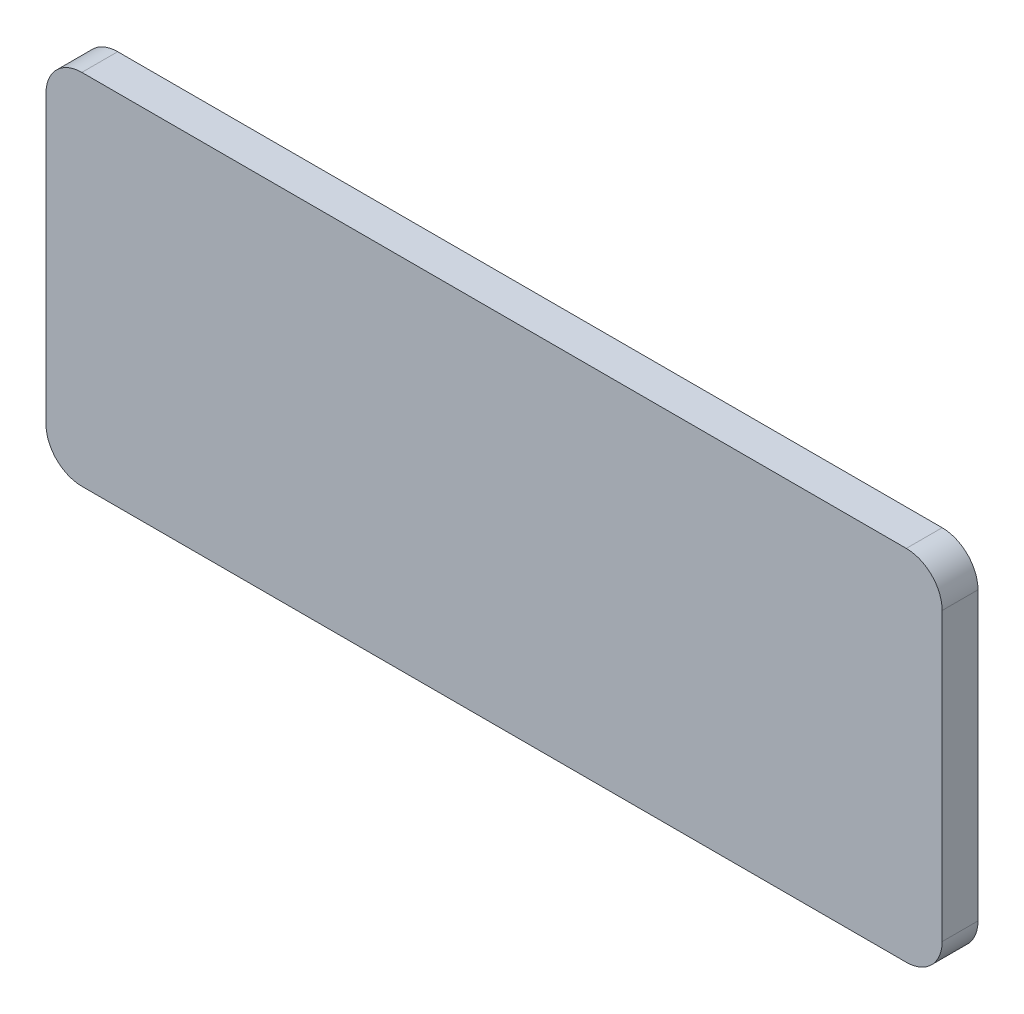
ISO-10303-21;
HEADER;
FILE_DESCRIPTION(('STEP AP214'),'2;1');
FILE_NAME('part.step','',(''),(''),'','','');
FILE_SCHEMA(('AUTOMOTIVE_DESIGN { 1 0 10303 214 1 1 1 1 }'));
ENDSEC;
DATA;
#1=APPLICATION_CONTEXT('core data for automotive mechanical design processes');
#2=APPLICATION_PROTOCOL_DEFINITION('international standard','automotive_design',2000,#1);
#3=PRODUCT_CONTEXT('',#1,'mechanical');
#4=PRODUCT('Part','Part','',(#3));
#5=PRODUCT_RELATED_PRODUCT_CATEGORY('part','',(#4));
#6=PRODUCT_DEFINITION_FORMATION('','',#4);
#7=PRODUCT_DEFINITION_CONTEXT('part definition',#1,'design');
#8=PRODUCT_DEFINITION('design','',#6,#7);
#9=PRODUCT_DEFINITION_SHAPE('','',#8);
#10=(LENGTH_UNIT() NAMED_UNIT(*) SI_UNIT(.MILLI.,.METRE.));
#11=(NAMED_UNIT(*) PLANE_ANGLE_UNIT() SI_UNIT($,.RADIAN.));
#12=(NAMED_UNIT(*) SI_UNIT($,.STERADIAN.) SOLID_ANGLE_UNIT());
#13=UNCERTAINTY_MEASURE_WITH_UNIT(LENGTH_MEASURE(1.E-05),#10,'distance_accuracy_value','');
#14=(GEOMETRIC_REPRESENTATION_CONTEXT(3) GLOBAL_UNCERTAINTY_ASSIGNED_CONTEXT((#13)) GLOBAL_UNIT_ASSIGNED_CONTEXT((#10,
#11,#12)) REPRESENTATION_CONTEXT('',''));
#15=CARTESIAN_POINT('',(0.,0.,0.));
#16=DIRECTION('',(0.,0.,1.));
#17=DIRECTION('',(1.,0.,0.));
#18=AXIS2_PLACEMENT_3D('',#15,#16,#17);
#19=CARTESIAN_POINT('',(25.,-10.,2.));
#20=DIRECTION('',(-1.,0.,0.));
#21=DIRECTION('',(0.,0.,1.));
#22=AXIS2_PLACEMENT_3D('',#19,#20,#21);
#23=PLANE('',#22);
#24=DIRECTION('',(0.,1.,0.));
#25=VECTOR('',#24,1.);
#26=CARTESIAN_POINT('',(25.,-10.,2.));
#27=LINE('',#26,#25);
#28=CARTESIAN_POINT('',(25.,-8.,2.));
#29=VERTEX_POINT('',#28);
#30=CARTESIAN_POINT('',(25.,8.,2.));
#31=VERTEX_POINT('',#30);
#32=EDGE_CURVE('E137',#29,#31,#27,.T.);
#33=ORIENTED_EDGE('',*,*,#32,.F.);
#34=DIRECTION('',(0.,0.,-1.));
#35=VECTOR('',#34,1.);
#36=CARTESIAN_POINT('',(25.,-8.,2.));
#37=LINE('',#36,#35);
#38=CARTESIAN_POINT('',(25.,-8.,0.));
#39=VERTEX_POINT('',#38);
#40=EDGE_CURVE('E11',#29,#39,#37,.T.);
#41=ORIENTED_EDGE('',*,*,#40,.T.);
#42=DIRECTION('',(0.,1.,0.));
#43=VECTOR('',#42,1.);
#44=CARTESIAN_POINT('',(25.,-10.,0.));
#45=LINE('',#44,#43);
#46=CARTESIAN_POINT('',(25.,8.,0.));
#47=VERTEX_POINT('',#46);
#48=EDGE_CURVE('E183',#39,#47,#45,.T.);
#49=ORIENTED_EDGE('',*,*,#48,.T.);
#50=DIRECTION('',(0.,0.,-1.));
#51=VECTOR('',#50,1.);
#52=CARTESIAN_POINT('',(25.,8.,2.));
#53=LINE('',#52,#51);
#54=EDGE_CURVE('E48',#47,#31,#53,.F.);
#55=ORIENTED_EDGE('',*,*,#54,.T.);
#56=EDGE_LOOP('',(#33,#41,#49,#55));
#57=FACE_BOUND('',#56,.T.);
#58=ADVANCED_FACE('F39',(#57),#23,.F.);
#59=CARTESIAN_POINT('',(-25.,10.,2.));
#60=DIRECTION('',(0.,-1.,0.));
#61=DIRECTION('',(0.,0.,-1.));
#62=AXIS2_PLACEMENT_3D('',#59,#60,#61);
#63=PLANE('',#62);
#64=DIRECTION('',(-1.,0.,0.));
#65=VECTOR('',#64,1.);
#66=CARTESIAN_POINT('',(-25.,10.,0.));
#67=LINE('',#66,#65);
#68=CARTESIAN_POINT('',(23.,10.,0.));
#69=VERTEX_POINT('',#68);
#70=CARTESIAN_POINT('',(-23.,10.,0.));
#71=VERTEX_POINT('',#70);
#72=EDGE_CURVE('E144',#69,#71,#67,.T.);
#73=ORIENTED_EDGE('',*,*,#72,.T.);
#74=DIRECTION('',(0.,0.,-1.));
#75=VECTOR('',#74,1.);
#76=CARTESIAN_POINT('',(-23.,10.,2.));
#77=LINE('',#76,#75);
#78=CARTESIAN_POINT('',(-23.,10.,2.));
#79=VERTEX_POINT('',#78);
#80=EDGE_CURVE('E55',#71,#79,#77,.F.);
#81=ORIENTED_EDGE('',*,*,#80,.T.);
#82=DIRECTION('',(-1.,0.,0.));
#83=VECTOR('',#82,1.);
#84=CARTESIAN_POINT('',(-25.,10.,2.));
#85=LINE('',#84,#83);
#86=CARTESIAN_POINT('',(23.,10.,2.));
#87=VERTEX_POINT('',#86);
#88=EDGE_CURVE('E142',#87,#79,#85,.T.);
#89=ORIENTED_EDGE('',*,*,#88,.F.);
#90=DIRECTION('',(0.,0.,-1.));
#91=VECTOR('',#90,1.);
#92=CARTESIAN_POINT('',(23.,10.,2.));
#93=LINE('',#92,#91);
#94=EDGE_CURVE('E172',#87,#69,#93,.T.);
#95=ORIENTED_EDGE('',*,*,#94,.T.);
#96=EDGE_LOOP('',(#73,#81,#89,#95));
#97=FACE_BOUND('',#96,.T.);
#98=ADVANCED_FACE('F190',(#97),#63,.F.);
#99=CARTESIAN_POINT('',(-25.,-10.,2.));
#100=DIRECTION('',(1.,0.,0.));
#101=DIRECTION('',(0.,0.,-1.));
#102=AXIS2_PLACEMENT_3D('',#99,#100,#101);
#103=PLANE('',#102);
#104=DIRECTION('',(0.,-1.,0.));
#105=VECTOR('',#104,1.);
#106=CARTESIAN_POINT('',(-25.,-10.,0.));
#107=LINE('',#106,#105);
#108=CARTESIAN_POINT('',(-25.,8.,0.));
#109=VERTEX_POINT('',#108);
#110=CARTESIAN_POINT('',(-25.,-8.,0.));
#111=VERTEX_POINT('',#110);
#112=EDGE_CURVE('E138',#109,#111,#107,.T.);
#113=ORIENTED_EDGE('',*,*,#112,.T.);
#114=DIRECTION('',(0.,0.,-1.));
#115=VECTOR('',#114,1.);
#116=CARTESIAN_POINT('',(-25.,-8.,2.));
#117=LINE('',#116,#115);
#118=CARTESIAN_POINT('',(-25.,-8.,2.));
#119=VERTEX_POINT('',#118);
#120=EDGE_CURVE('E112',#111,#119,#117,.F.);
#121=ORIENTED_EDGE('',*,*,#120,.T.);
#122=DIRECTION('',(0.,-1.,0.));
#123=VECTOR('',#122,1.);
#124=CARTESIAN_POINT('',(-25.,-10.,2.));
#125=LINE('',#124,#123);
#126=CARTESIAN_POINT('',(-25.,8.,2.));
#127=VERTEX_POINT('',#126);
#128=EDGE_CURVE('E197',#127,#119,#125,.T.);
#129=ORIENTED_EDGE('',*,*,#128,.F.);
#130=DIRECTION('',(0.,0.,-1.));
#131=VECTOR('',#130,1.);
#132=CARTESIAN_POINT('',(-25.,8.,2.));
#133=LINE('',#132,#131);
#134=EDGE_CURVE('E118',#127,#109,#133,.T.);
#135=ORIENTED_EDGE('',*,*,#134,.T.);
#136=EDGE_LOOP('',(#113,#121,#129,#135));
#137=FACE_BOUND('',#136,.T.);
#138=ADVANCED_FACE('F207',(#137),#103,.F.);
#139=CARTESIAN_POINT('',(-25.,-10.,2.));
#140=DIRECTION('',(0.,1.,0.));
#141=DIRECTION('',(0.,0.,1.));
#142=AXIS2_PLACEMENT_3D('',#139,#140,#141);
#143=PLANE('',#142);
#144=DIRECTION('',(1.,0.,0.));
#145=VECTOR('',#144,1.);
#146=CARTESIAN_POINT('',(-25.,-10.,2.));
#147=LINE('',#146,#145);
#148=CARTESIAN_POINT('',(-23.,-10.,2.));
#149=VERTEX_POINT('',#148);
#150=CARTESIAN_POINT('',(23.,-10.,2.));
#151=VERTEX_POINT('',#150);
#152=EDGE_CURVE('E128',#149,#151,#147,.T.);
#153=ORIENTED_EDGE('',*,*,#152,.F.);
#154=DIRECTION('',(0.,0.,-1.));
#155=VECTOR('',#154,1.);
#156=CARTESIAN_POINT('',(-23.,-10.,2.));
#157=LINE('',#156,#155);
#158=CARTESIAN_POINT('',(-23.,-10.,0.));
#159=VERTEX_POINT('',#158);
#160=EDGE_CURVE('E111',#149,#159,#157,.T.);
#161=ORIENTED_EDGE('',*,*,#160,.T.);
#162=DIRECTION('',(1.,0.,0.));
#163=VECTOR('',#162,1.);
#164=CARTESIAN_POINT('',(-25.,-10.,0.));
#165=LINE('',#164,#163);
#166=CARTESIAN_POINT('',(23.,-10.,0.));
#167=VERTEX_POINT('',#166);
#168=EDGE_CURVE('E125',#159,#167,#165,.T.);
#169=ORIENTED_EDGE('',*,*,#168,.T.);
#170=DIRECTION('',(0.,0.,-1.));
#171=VECTOR('',#170,1.);
#172=CARTESIAN_POINT('',(23.,-10.,2.));
#173=LINE('',#172,#171);
#174=EDGE_CURVE('E131',#167,#151,#173,.F.);
#175=ORIENTED_EDGE('',*,*,#174,.T.);
#176=EDGE_LOOP('',(#153,#161,#169,#175));
#177=FACE_BOUND('',#176,.T.);
#178=ADVANCED_FACE('F124',(#177),#143,.F.);
#179=CARTESIAN_POINT('',(0.,0.,2.));
#180=DIRECTION('',(0.,0.,-1.));
#181=DIRECTION('',(-1.,0.,0.));
#182=AXIS2_PLACEMENT_3D('',#179,#180,#181);
#183=PLANE('',#182);
#184=ORIENTED_EDGE('',*,*,#128,.T.);
#185=CARTESIAN_POINT('',(-23.,-8.,2.));
#186=DIRECTION('',(0.,0.,-1.));
#187=DIRECTION('',(-1.,0.,0.));
#188=AXIS2_PLACEMENT_3D('',#185,#186,#187);
#189=CIRCLE('',#188,2.);
#190=EDGE_CURVE('E169',#119,#149,#189,.F.);
#191=ORIENTED_EDGE('',*,*,#190,.T.);
#192=ORIENTED_EDGE('',*,*,#152,.T.);
#193=CARTESIAN_POINT('',(23.,-8.,2.));
#194=DIRECTION('',(0.,0.,-1.));
#195=DIRECTION('',(-1.,0.,0.));
#196=AXIS2_PLACEMENT_3D('',#193,#194,#195);
#197=CIRCLE('',#196,2.);
#198=EDGE_CURVE('E163',#151,#29,#197,.F.);
#199=ORIENTED_EDGE('',*,*,#198,.T.);
#200=ORIENTED_EDGE('',*,*,#32,.T.);
#201=CARTESIAN_POINT('',(23.,8.,2.));
#202=DIRECTION('',(0.,0.,-1.));
#203=DIRECTION('',(-1.,0.,0.));
#204=AXIS2_PLACEMENT_3D('',#201,#202,#203);
#205=CIRCLE('',#204,2.);
#206=EDGE_CURVE('E62',#31,#87,#205,.F.);
#207=ORIENTED_EDGE('',*,*,#206,.T.);
#208=ORIENTED_EDGE('',*,*,#88,.T.);
#209=CARTESIAN_POINT('',(-23.,8.,2.));
#210=DIRECTION('',(0.,0.,-1.));
#211=DIRECTION('',(-1.,0.,0.));
#212=AXIS2_PLACEMENT_3D('',#209,#210,#211);
#213=CIRCLE('',#212,2.);
#214=EDGE_CURVE('E166',#79,#127,#213,.F.);
#215=ORIENTED_EDGE('',*,*,#214,.T.);
#216=EDGE_LOOP('',(#184,#191,#192,#199,#200,#207,#208,#215));
#217=FACE_BOUND('',#216,.T.);
#218=ADVANCED_FACE('F186',(#217),#183,.F.);
#219=CARTESIAN_POINT('',(0.,0.,0.));
#220=DIRECTION('',(0.,0.,-1.));
#221=DIRECTION('',(-1.,0.,0.));
#222=AXIS2_PLACEMENT_3D('',#219,#220,#221);
#223=PLANE('',#222);
#224=ORIENTED_EDGE('',*,*,#168,.F.);
#225=CARTESIAN_POINT('',(-23.,-8.,0.));
#226=DIRECTION('',(0.,0.,-1.));
#227=DIRECTION('',(-1.,0.,0.));
#228=AXIS2_PLACEMENT_3D('',#225,#226,#227);
#229=CIRCLE('',#228,2.);
#230=EDGE_CURVE('E107',#159,#111,#229,.T.);
#231=ORIENTED_EDGE('',*,*,#230,.T.);
#232=ORIENTED_EDGE('',*,*,#112,.F.);
#233=CARTESIAN_POINT('',(-23.,8.,0.));
#234=DIRECTION('',(0.,0.,-1.));
#235=DIRECTION('',(-1.,0.,0.));
#236=AXIS2_PLACEMENT_3D('',#233,#234,#235);
#237=CIRCLE('',#236,2.);
#238=EDGE_CURVE('E119',#109,#71,#237,.T.);
#239=ORIENTED_EDGE('',*,*,#238,.T.);
#240=ORIENTED_EDGE('',*,*,#72,.F.);
#241=CARTESIAN_POINT('',(23.,8.,0.));
#242=DIRECTION('',(0.,0.,-1.));
#243=DIRECTION('',(-1.,0.,0.));
#244=AXIS2_PLACEMENT_3D('',#241,#242,#243);
#245=CIRCLE('',#244,2.);
#246=EDGE_CURVE('E130',#69,#47,#245,.T.);
#247=ORIENTED_EDGE('',*,*,#246,.T.);
#248=ORIENTED_EDGE('',*,*,#48,.F.);
#249=CARTESIAN_POINT('',(23.,-8.,0.));
#250=DIRECTION('',(0.,0.,-1.));
#251=DIRECTION('',(-1.,0.,0.));
#252=AXIS2_PLACEMENT_3D('',#249,#250,#251);
#253=CIRCLE('',#252,2.);
#254=EDGE_CURVE('E135',#39,#167,#253,.T.);
#255=ORIENTED_EDGE('',*,*,#254,.T.);
#256=EDGE_LOOP('',(#224,#231,#232,#239,#240,#247,#248,#255));
#257=FACE_BOUND('',#256,.T.);
#258=ADVANCED_FACE('F133',(#257),#223,.T.);
#259=CARTESIAN_POINT('',(-23.,-8.,2.));
#260=DIRECTION('',(0.,0.,-1.));
#261=DIRECTION('',(-1.,0.,0.));
#262=AXIS2_PLACEMENT_3D('',#259,#260,#261);
#263=CYLINDRICAL_SURFACE('',#262,2.);
#264=ORIENTED_EDGE('',*,*,#190,.F.);
#265=ORIENTED_EDGE('',*,*,#120,.F.);
#266=ORIENTED_EDGE('',*,*,#230,.F.);
#267=ORIENTED_EDGE('',*,*,#160,.F.);
#268=EDGE_LOOP('',(#264,#265,#266,#267));
#269=FACE_BOUND('',#268,.T.);
#270=ADVANCED_FACE('F110',(#269),#263,.T.);
#271=CARTESIAN_POINT('',(-23.,8.,2.));
#272=DIRECTION('',(0.,0.,-1.));
#273=DIRECTION('',(-1.,0.,0.));
#274=AXIS2_PLACEMENT_3D('',#271,#272,#273);
#275=CYLINDRICAL_SURFACE('',#274,2.);
#276=ORIENTED_EDGE('',*,*,#214,.F.);
#277=ORIENTED_EDGE('',*,*,#80,.F.);
#278=ORIENTED_EDGE('',*,*,#238,.F.);
#279=ORIENTED_EDGE('',*,*,#134,.F.);
#280=EDGE_LOOP('',(#276,#277,#278,#279));
#281=FACE_BOUND('',#280,.T.);
#282=ADVANCED_FACE('F205',(#281),#275,.T.);
#283=CARTESIAN_POINT('',(23.,-8.,2.));
#284=DIRECTION('',(0.,0.,-1.));
#285=DIRECTION('',(-1.,0.,0.));
#286=AXIS2_PLACEMENT_3D('',#283,#284,#285);
#287=CYLINDRICAL_SURFACE('',#286,2.);
#288=ORIENTED_EDGE('',*,*,#198,.F.);
#289=ORIENTED_EDGE('',*,*,#174,.F.);
#290=ORIENTED_EDGE('',*,*,#254,.F.);
#291=ORIENTED_EDGE('',*,*,#40,.F.);
#292=EDGE_LOOP('',(#288,#289,#290,#291));
#293=FACE_BOUND('',#292,.T.);
#294=ADVANCED_FACE('F209',(#293),#287,.T.);
#295=CARTESIAN_POINT('',(23.,8.,2.));
#296=DIRECTION('',(0.,0.,-1.));
#297=DIRECTION('',(-1.,0.,0.));
#298=AXIS2_PLACEMENT_3D('',#295,#296,#297);
#299=CYLINDRICAL_SURFACE('',#298,2.);
#300=ORIENTED_EDGE('',*,*,#206,.F.);
#301=ORIENTED_EDGE('',*,*,#54,.F.);
#302=ORIENTED_EDGE('',*,*,#246,.F.);
#303=ORIENTED_EDGE('',*,*,#94,.F.);
#304=EDGE_LOOP('',(#300,#301,#302,#303));
#305=FACE_BOUND('',#304,.T.);
#306=ADVANCED_FACE('F41',(#305),#299,.T.);
#307=CLOSED_SHELL('',(#58,#98,#138,#178,#218,#258,#270,#282,#294,#306));
#308=MANIFOLD_SOLID_BREP('B2',#307);
#309=ADVANCED_BREP_SHAPE_REPRESENTATION('',(#18,#308),#14);
#310=SHAPE_DEFINITION_REPRESENTATION(#9,#309);
ENDSEC;
END-ISO-10303-21;
